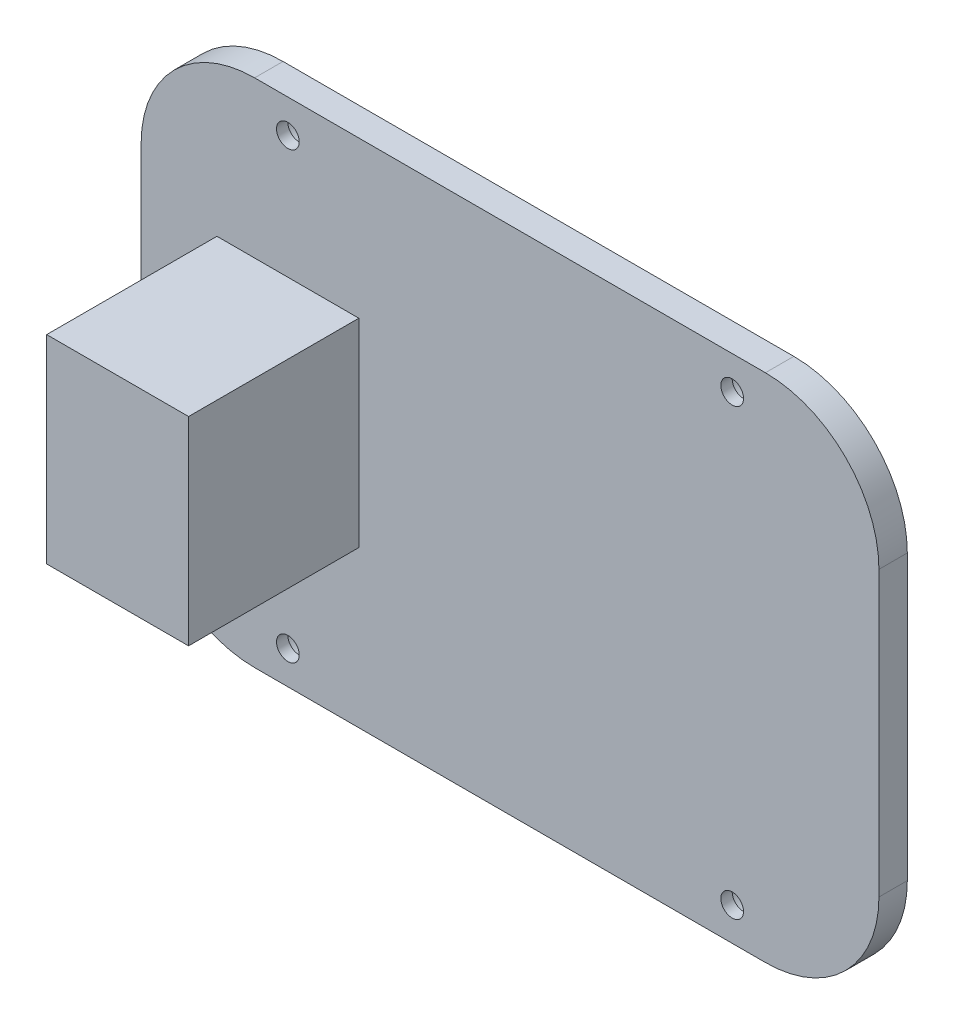
ISO-10303-21;
HEADER;
FILE_DESCRIPTION(('STEP AP214'),'2;1');
FILE_NAME('part.step','',(''),(''),'','','');
FILE_SCHEMA(('AUTOMOTIVE_DESIGN { 1 0 10303 214 1 1 1 1 }'));
ENDSEC;
DATA;
#1=APPLICATION_CONTEXT('core data for automotive mechanical design processes');
#2=APPLICATION_PROTOCOL_DEFINITION('international standard','automotive_design',2000,#1);
#3=PRODUCT_CONTEXT('',#1,'mechanical');
#4=PRODUCT('Part','Part','',(#3));
#5=PRODUCT_RELATED_PRODUCT_CATEGORY('part','',(#4));
#6=PRODUCT_DEFINITION_FORMATION('','',#4);
#7=PRODUCT_DEFINITION_CONTEXT('part definition',#1,'design');
#8=PRODUCT_DEFINITION('design','',#6,#7);
#9=PRODUCT_DEFINITION_SHAPE('','',#8);
#10=(LENGTH_UNIT() NAMED_UNIT(*) SI_UNIT(.MILLI.,.METRE.));
#11=(NAMED_UNIT(*) PLANE_ANGLE_UNIT() SI_UNIT($,.RADIAN.));
#12=(NAMED_UNIT(*) SI_UNIT($,.STERADIAN.) SOLID_ANGLE_UNIT());
#13=UNCERTAINTY_MEASURE_WITH_UNIT(LENGTH_MEASURE(1.E-05),#10,'distance_accuracy_value','');
#14=(GEOMETRIC_REPRESENTATION_CONTEXT(3) GLOBAL_UNCERTAINTY_ASSIGNED_CONTEXT((#13)) GLOBAL_UNIT_ASSIGNED_CONTEXT((#10,
#11,#12)) REPRESENTATION_CONTEXT('',''));
#15=CARTESIAN_POINT('',(0.,0.,0.));
#16=DIRECTION('',(0.,0.,1.));
#17=DIRECTION('',(1.,0.,0.));
#18=AXIS2_PLACEMENT_3D('',#15,#16,#17);
#19=CARTESIAN_POINT('',(0.,0.,5.));
#20=DIRECTION('',(0.,0.,-1.));
#21=DIRECTION('',(-1.,0.,0.));
#22=AXIS2_PLACEMENT_3D('',#19,#20,#21);
#23=PLANE('',#22);
#24=DIRECTION('',(1.,0.,0.));
#25=VECTOR('',#24,1.);
#26=CARTESIAN_POINT('',(-65.,-45.,5.));
#27=LINE('',#26,#25);
#28=CARTESIAN_POINT('',(-45.,-45.,5.));
#29=VERTEX_POINT('',#28);
#30=CARTESIAN_POINT('',(45.,-45.,5.));
#31=VERTEX_POINT('',#30);
#32=EDGE_CURVE('E204',#29,#31,#27,.T.);
#33=ORIENTED_EDGE('',*,*,#32,.T.);
#34=CARTESIAN_POINT('',(45.,-25.,5.));
#35=DIRECTION('',(0.,0.,-1.));
#36=DIRECTION('',(-1.,0.,0.));
#37=AXIS2_PLACEMENT_3D('',#34,#35,#36);
#38=CIRCLE('',#37,20.);
#39=CARTESIAN_POINT('',(65.,-25.,5.));
#40=VERTEX_POINT('',#39);
#41=EDGE_CURVE('E241',#31,#40,#38,.F.);
#42=ORIENTED_EDGE('',*,*,#41,.T.);
#43=DIRECTION('',(0.,1.,0.));
#44=VECTOR('',#43,1.);
#45=CARTESIAN_POINT('',(65.,-45.,5.));
#46=LINE('',#45,#44);
#47=CARTESIAN_POINT('',(65.,25.,5.));
#48=VERTEX_POINT('',#47);
#49=EDGE_CURVE('E194',#40,#48,#46,.T.);
#50=ORIENTED_EDGE('',*,*,#49,.T.);
#51=CARTESIAN_POINT('',(45.,25.,5.));
#52=DIRECTION('',(0.,0.,-1.));
#53=DIRECTION('',(-1.,0.,0.));
#54=AXIS2_PLACEMENT_3D('',#51,#52,#53);
#55=CIRCLE('',#54,20.);
#56=CARTESIAN_POINT('',(45.,45.,5.));
#57=VERTEX_POINT('',#56);
#58=EDGE_CURVE('E237',#48,#57,#55,.F.);
#59=ORIENTED_EDGE('',*,*,#58,.T.);
#60=DIRECTION('',(-1.,0.,0.));
#61=VECTOR('',#60,1.);
#62=CARTESIAN_POINT('',(-65.,45.,5.));
#63=LINE('',#62,#61);
#64=CARTESIAN_POINT('',(-45.,45.,5.));
#65=VERTEX_POINT('',#64);
#66=EDGE_CURVE('E197',#57,#65,#63,.T.);
#67=ORIENTED_EDGE('',*,*,#66,.T.);
#68=CARTESIAN_POINT('',(-45.,25.,5.));
#69=DIRECTION('',(0.,0.,-1.));
#70=DIRECTION('',(-1.,0.,0.));
#71=AXIS2_PLACEMENT_3D('',#68,#69,#70);
#72=CIRCLE('',#71,20.);
#73=CARTESIAN_POINT('',(-65.,25.,5.));
#74=VERTEX_POINT('',#73);
#75=EDGE_CURVE('E235',#65,#74,#72,.F.);
#76=ORIENTED_EDGE('',*,*,#75,.T.);
#77=DIRECTION('',(0.,-1.,0.));
#78=VECTOR('',#77,1.);
#79=CARTESIAN_POINT('',(-65.,-45.,5.));
#80=LINE('',#79,#78);
#81=CARTESIAN_POINT('',(-65.,-25.,5.));
#82=VERTEX_POINT('',#81);
#83=EDGE_CURVE('E201',#74,#82,#80,.T.);
#84=ORIENTED_EDGE('',*,*,#83,.T.);
#85=CARTESIAN_POINT('',(-45.,-25.,5.));
#86=DIRECTION('',(0.,0.,-1.));
#87=DIRECTION('',(-1.,0.,0.));
#88=AXIS2_PLACEMENT_3D('',#85,#86,#87);
#89=CIRCLE('',#88,20.);
#90=EDGE_CURVE('E239',#82,#29,#89,.F.);
#91=ORIENTED_EDGE('',*,*,#90,.T.);
#92=EDGE_LOOP('',(#33,#42,#50,#59,#67,#76,#84,#91));
#93=FACE_BOUND('',#92,.T.);
#94=CARTESIAN_POINT('',(39.1421356237308,39.1421356237309,5.));
#95=DIRECTION('',(0.,0.,-1.));
#96=DIRECTION('',(-1.,0.,0.));
#97=AXIS2_PLACEMENT_3D('',#94,#95,#96);
#98=CIRCLE('',#97,2.);
#99=CARTESIAN_POINT('',(37.1421356237308,39.1421356237309,5.));
#100=VERTEX_POINT('',#99);
#101=EDGE_CURVE('E163',#100,#100,#98,.T.);
#102=ORIENTED_EDGE('',*,*,#101,.T.);
#103=EDGE_LOOP('',(#102));
#104=FACE_BOUND('',#103,.T.);
#105=CARTESIAN_POINT('',(-39.1421356237308,39.1421356237309,5.));
#106=DIRECTION('',(0.,0.,-1.));
#107=DIRECTION('',(-1.,0.,0.));
#108=AXIS2_PLACEMENT_3D('',#105,#106,#107);
#109=CIRCLE('',#108,2.);
#110=CARTESIAN_POINT('',(-41.1421356237308,39.1421356237309,5.));
#111=VERTEX_POINT('',#110);
#112=EDGE_CURVE('E160',#111,#111,#109,.T.);
#113=ORIENTED_EDGE('',*,*,#112,.T.);
#114=EDGE_LOOP('',(#113));
#115=FACE_BOUND('',#114,.T.);
#116=CARTESIAN_POINT('',(-39.1421356237308,-39.1421356237309,5.));
#117=DIRECTION('',(0.,0.,-1.));
#118=DIRECTION('',(-1.,0.,0.));
#119=AXIS2_PLACEMENT_3D('',#116,#117,#118);
#120=CIRCLE('',#119,2.);
#121=CARTESIAN_POINT('',(-41.1421356237308,-39.1421356237309,5.));
#122=VERTEX_POINT('',#121);
#123=EDGE_CURVE('E154',#122,#122,#120,.T.);
#124=ORIENTED_EDGE('',*,*,#123,.T.);
#125=EDGE_LOOP('',(#124));
#126=FACE_BOUND('',#125,.T.);
#127=CARTESIAN_POINT('',(39.1421356237308,-39.1421356237309,5.));
#128=DIRECTION('',(0.,0.,-1.));
#129=DIRECTION('',(-1.,0.,0.));
#130=AXIS2_PLACEMENT_3D('',#127,#128,#129);
#131=CIRCLE('',#130,2.);
#132=CARTESIAN_POINT('',(37.1421356237308,-39.1421356237309,5.));
#133=VERTEX_POINT('',#132);
#134=EDGE_CURVE('E151',#133,#133,#131,.T.);
#135=ORIENTED_EDGE('',*,*,#134,.T.);
#136=EDGE_LOOP('',(#135));
#137=FACE_BOUND('',#136,.T.);
#138=DIRECTION('',(0.,1.,0.));
#139=VECTOR('',#138,1.);
#140=CARTESIAN_POINT('',(-26.6421356237308,-17.5,5.));
#141=LINE('',#140,#139);
#142=CARTESIAN_POINT('',(-26.6421356237308,-17.5,5.));
#143=VERTEX_POINT('',#142);
#144=CARTESIAN_POINT('',(-26.6421356237308,17.5,5.));
#145=VERTEX_POINT('',#144);
#146=EDGE_CURVE('E150',#143,#145,#141,.T.);
#147=ORIENTED_EDGE('',*,*,#146,.F.);
#148=DIRECTION('',(1.,0.,0.));
#149=VECTOR('',#148,1.);
#150=CARTESIAN_POINT('',(-51.6421356237308,-17.5,5.));
#151=LINE('',#150,#149);
#152=CARTESIAN_POINT('',(-51.6421356237308,-17.5,5.));
#153=VERTEX_POINT('',#152);
#154=EDGE_CURVE('E147',#153,#143,#151,.T.);
#155=ORIENTED_EDGE('',*,*,#154,.F.);
#156=DIRECTION('',(0.,-1.,0.));
#157=VECTOR('',#156,1.);
#158=CARTESIAN_POINT('',(-51.6421356237308,-17.5,5.));
#159=LINE('',#158,#157);
#160=CARTESIAN_POINT('',(-51.6421356237308,17.5,5.));
#161=VERTEX_POINT('',#160);
#162=EDGE_CURVE('E61',#161,#153,#159,.T.);
#163=ORIENTED_EDGE('',*,*,#162,.F.);
#164=DIRECTION('',(-1.,0.,0.));
#165=VECTOR('',#164,1.);
#166=CARTESIAN_POINT('',(-51.6421356237308,17.5,5.));
#167=LINE('',#166,#165);
#168=EDGE_CURVE('E56',#145,#161,#167,.T.);
#169=ORIENTED_EDGE('',*,*,#168,.F.);
#170=EDGE_LOOP('',(#147,#155,#163,#169));
#171=FACE_BOUND('',#170,.T.);
#172=ADVANCED_FACE('F39',(#93,#104,#115,#126,#137,#171),#23,.F.);
#173=CARTESIAN_POINT('',(65.,-45.,5.));
#174=DIRECTION('',(-1.,0.,0.));
#175=DIRECTION('',(0.,0.,1.));
#176=AXIS2_PLACEMENT_3D('',#173,#174,#175);
#177=PLANE('',#176);
#178=ORIENTED_EDGE('',*,*,#49,.F.);
#179=DIRECTION('',(0.,0.,-1.));
#180=VECTOR('',#179,1.);
#181=CARTESIAN_POINT('',(65.,-25.,5.));
#182=LINE('',#181,#180);
#183=CARTESIAN_POINT('',(65.,-25.,0.));
#184=VERTEX_POINT('',#183);
#185=EDGE_CURVE('E219',#40,#184,#182,.T.);
#186=ORIENTED_EDGE('',*,*,#185,.T.);
#187=DIRECTION('',(0.,1.,0.));
#188=VECTOR('',#187,1.);
#189=CARTESIAN_POINT('',(65.,-45.,0.));
#190=LINE('',#189,#188);
#191=CARTESIAN_POINT('',(65.,25.,0.));
#192=VERTEX_POINT('',#191);
#193=EDGE_CURVE('E191',#184,#192,#190,.T.);
#194=ORIENTED_EDGE('',*,*,#193,.T.);
#195=DIRECTION('',(0.,0.,-1.));
#196=VECTOR('',#195,1.);
#197=CARTESIAN_POINT('',(65.,25.,5.));
#198=LINE('',#197,#196);
#199=EDGE_CURVE('E207',#192,#48,#198,.F.);
#200=ORIENTED_EDGE('',*,*,#199,.T.);
#201=EDGE_LOOP('',(#178,#186,#194,#200));
#202=FACE_BOUND('',#201,.T.);
#203=ADVANCED_FACE('F289',(#202),#177,.F.);
#204=CARTESIAN_POINT('',(-65.,45.,5.));
#205=DIRECTION('',(0.,-1.,0.));
#206=DIRECTION('',(0.,0.,-1.));
#207=AXIS2_PLACEMENT_3D('',#204,#205,#206);
#208=PLANE('',#207);
#209=ORIENTED_EDGE('',*,*,#66,.F.);
#210=DIRECTION('',(0.,0.,-1.));
#211=VECTOR('',#210,1.);
#212=CARTESIAN_POINT('',(45.,45.,5.));
#213=LINE('',#212,#211);
#214=CARTESIAN_POINT('',(45.,45.,0.));
#215=VERTEX_POINT('',#214);
#216=EDGE_CURVE('E11',#57,#215,#213,.T.);
#217=ORIENTED_EDGE('',*,*,#216,.T.);
#218=DIRECTION('',(-1.,0.,0.));
#219=VECTOR('',#218,1.);
#220=CARTESIAN_POINT('',(-65.,45.,0.));
#221=LINE('',#220,#219);
#222=CARTESIAN_POINT('',(-45.,45.,0.));
#223=VERTEX_POINT('',#222);
#224=EDGE_CURVE('E210',#215,#223,#221,.T.);
#225=ORIENTED_EDGE('',*,*,#224,.T.);
#226=DIRECTION('',(0.,0.,-1.));
#227=VECTOR('',#226,1.);
#228=CARTESIAN_POINT('',(-45.,45.,5.));
#229=LINE('',#228,#227);
#230=EDGE_CURVE('E48',#223,#65,#229,.F.);
#231=ORIENTED_EDGE('',*,*,#230,.T.);
#232=EDGE_LOOP('',(#209,#217,#225,#231));
#233=FACE_BOUND('',#232,.T.);
#234=ADVANCED_FACE('F300',(#233),#208,.F.);
#235=CARTESIAN_POINT('',(-65.,-45.,5.));
#236=DIRECTION('',(1.,0.,0.));
#237=DIRECTION('',(0.,0.,-1.));
#238=AXIS2_PLACEMENT_3D('',#235,#236,#237);
#239=PLANE('',#238);
#240=DIRECTION('',(0.,-1.,0.));
#241=VECTOR('',#240,1.);
#242=CARTESIAN_POINT('',(-65.,-45.,0.));
#243=LINE('',#242,#241);
#244=CARTESIAN_POINT('',(-65.,25.,0.));
#245=VERTEX_POINT('',#244);
#246=CARTESIAN_POINT('',(-65.,-25.,0.));
#247=VERTEX_POINT('',#246);
#248=EDGE_CURVE('E213',#245,#247,#243,.T.);
#249=ORIENTED_EDGE('',*,*,#248,.T.);
#250=DIRECTION('',(0.,0.,-1.));
#251=VECTOR('',#250,1.);
#252=CARTESIAN_POINT('',(-65.,-25.,5.));
#253=LINE('',#252,#251);
#254=EDGE_CURVE('E246',#247,#82,#253,.F.);
#255=ORIENTED_EDGE('',*,*,#254,.T.);
#256=ORIENTED_EDGE('',*,*,#83,.F.);
#257=DIRECTION('',(0.,0.,-1.));
#258=VECTOR('',#257,1.);
#259=CARTESIAN_POINT('',(-65.,25.,5.));
#260=LINE('',#259,#258);
#261=EDGE_CURVE('E243',#74,#245,#260,.T.);
#262=ORIENTED_EDGE('',*,*,#261,.T.);
#263=EDGE_LOOP('',(#249,#255,#256,#262));
#264=FACE_BOUND('',#263,.T.);
#265=ADVANCED_FACE('F307',(#264),#239,.F.);
#266=CARTESIAN_POINT('',(-65.,-45.,5.));
#267=DIRECTION('',(0.,1.,0.));
#268=DIRECTION('',(0.,0.,1.));
#269=AXIS2_PLACEMENT_3D('',#266,#267,#268);
#270=PLANE('',#269);
#271=DIRECTION('',(1.,0.,0.));
#272=VECTOR('',#271,1.);
#273=CARTESIAN_POINT('',(-65.,-45.,0.));
#274=LINE('',#273,#272);
#275=CARTESIAN_POINT('',(-45.,-45.,0.));
#276=VERTEX_POINT('',#275);
#277=CARTESIAN_POINT('',(45.,-45.,0.));
#278=VERTEX_POINT('',#277);
#279=EDGE_CURVE('E198',#276,#278,#274,.T.);
#280=ORIENTED_EDGE('',*,*,#279,.T.);
#281=DIRECTION('',(0.,0.,-1.));
#282=VECTOR('',#281,1.);
#283=CARTESIAN_POINT('',(45.,-45.,5.));
#284=LINE('',#283,#282);
#285=EDGE_CURVE('E233',#278,#31,#284,.F.);
#286=ORIENTED_EDGE('',*,*,#285,.T.);
#287=ORIENTED_EDGE('',*,*,#32,.F.);
#288=DIRECTION('',(0.,0.,-1.));
#289=VECTOR('',#288,1.);
#290=CARTESIAN_POINT('',(-45.,-45.,5.));
#291=LINE('',#290,#289);
#292=EDGE_CURVE('E230',#29,#276,#291,.T.);
#293=ORIENTED_EDGE('',*,*,#292,.T.);
#294=EDGE_LOOP('',(#280,#286,#287,#293));
#295=FACE_BOUND('',#294,.T.);
#296=ADVANCED_FACE('F280',(#295),#270,.F.);
#297=CARTESIAN_POINT('',(0.,0.,0.));
#298=DIRECTION('',(0.,0.,-1.));
#299=DIRECTION('',(-1.,0.,0.));
#300=AXIS2_PLACEMENT_3D('',#297,#298,#299);
#301=PLANE('',#300);
#302=CARTESIAN_POINT('',(-39.1421356237308,39.1421356237309,0.));
#303=DIRECTION('',(0.,0.,-1.));
#304=DIRECTION('',(-1.,0.,0.));
#305=AXIS2_PLACEMENT_3D('',#302,#303,#304);
#306=CIRCLE('',#305,4.00000000000001);
#307=CARTESIAN_POINT('',(-43.1421356237308,39.1421356237309,0.));
#308=VERTEX_POINT('',#307);
#309=EDGE_CURVE('E180',#308,#308,#306,.T.);
#310=ORIENTED_EDGE('',*,*,#309,.F.);
#311=EDGE_LOOP('',(#310));
#312=FACE_BOUND('',#311,.T.);
#313=CARTESIAN_POINT('',(39.1421356237308,-39.1421356237309,0.));
#314=DIRECTION('',(0.,0.,-1.));
#315=DIRECTION('',(-1.,0.,0.));
#316=AXIS2_PLACEMENT_3D('',#313,#314,#315);
#317=CIRCLE('',#316,4.00000000000001);
#318=CARTESIAN_POINT('',(35.1421356237308,-39.1421356237309,0.));
#319=VERTEX_POINT('',#318);
#320=EDGE_CURVE('E172',#319,#319,#317,.T.);
#321=ORIENTED_EDGE('',*,*,#320,.F.);
#322=EDGE_LOOP('',(#321));
#323=FACE_BOUND('',#322,.T.);
#324=CARTESIAN_POINT('',(-39.1421356237308,-39.1421356237309,0.));
#325=DIRECTION('',(0.,0.,-1.));
#326=DIRECTION('',(-1.,0.,0.));
#327=AXIS2_PLACEMENT_3D('',#324,#325,#326);
#328=CIRCLE('',#327,4.00000000000001);
#329=CARTESIAN_POINT('',(-43.1421356237308,-39.1421356237309,0.));
#330=VERTEX_POINT('',#329);
#331=EDGE_CURVE('E173',#330,#330,#328,.T.);
#332=ORIENTED_EDGE('',*,*,#331,.F.);
#333=EDGE_LOOP('',(#332));
#334=FACE_BOUND('',#333,.T.);
#335=CARTESIAN_POINT('',(39.1421356237308,39.1421356237309,0.));
#336=DIRECTION('',(0.,0.,-1.));
#337=DIRECTION('',(-1.,0.,0.));
#338=AXIS2_PLACEMENT_3D('',#335,#336,#337);
#339=CIRCLE('',#338,4.00000000000001);
#340=CARTESIAN_POINT('',(35.1421356237308,39.1421356237309,0.));
#341=VERTEX_POINT('',#340);
#342=EDGE_CURVE('E179',#341,#341,#339,.T.);
#343=ORIENTED_EDGE('',*,*,#342,.F.);
#344=EDGE_LOOP('',(#343));
#345=FACE_BOUND('',#344,.T.);
#346=ORIENTED_EDGE('',*,*,#193,.F.);
#347=CARTESIAN_POINT('',(45.,-25.,0.));
#348=DIRECTION('',(0.,0.,-1.));
#349=DIRECTION('',(-1.,0.,0.));
#350=AXIS2_PLACEMENT_3D('',#347,#348,#349);
#351=CIRCLE('',#350,20.);
#352=EDGE_CURVE('E228',#184,#278,#351,.T.);
#353=ORIENTED_EDGE('',*,*,#352,.T.);
#354=ORIENTED_EDGE('',*,*,#279,.F.);
#355=CARTESIAN_POINT('',(-45.,-25.,0.));
#356=DIRECTION('',(0.,0.,-1.));
#357=DIRECTION('',(-1.,0.,0.));
#358=AXIS2_PLACEMENT_3D('',#355,#356,#357);
#359=CIRCLE('',#358,20.);
#360=EDGE_CURVE('E226',#276,#247,#359,.T.);
#361=ORIENTED_EDGE('',*,*,#360,.T.);
#362=ORIENTED_EDGE('',*,*,#248,.F.);
#363=CARTESIAN_POINT('',(-45.,25.,0.));
#364=DIRECTION('',(0.,0.,-1.));
#365=DIRECTION('',(-1.,0.,0.));
#366=AXIS2_PLACEMENT_3D('',#363,#364,#365);
#367=CIRCLE('',#366,20.);
#368=EDGE_CURVE('E222',#245,#223,#367,.T.);
#369=ORIENTED_EDGE('',*,*,#368,.T.);
#370=ORIENTED_EDGE('',*,*,#224,.F.);
#371=CARTESIAN_POINT('',(45.,25.,0.));
#372=DIRECTION('',(0.,0.,-1.));
#373=DIRECTION('',(-1.,0.,0.));
#374=AXIS2_PLACEMENT_3D('',#371,#372,#373);
#375=CIRCLE('',#374,20.);
#376=EDGE_CURVE('E224',#215,#192,#375,.T.);
#377=ORIENTED_EDGE('',*,*,#376,.T.);
#378=EDGE_LOOP('',(#346,#353,#354,#361,#362,#369,#370,#377));
#379=FACE_BOUND('',#378,.T.);
#380=ADVANCED_FACE('F276',(#312,#323,#334,#345,#379),#301,.T.);
#381=CARTESIAN_POINT('',(45.,-25.,5.));
#382=DIRECTION('',(0.,0.,-1.));
#383=DIRECTION('',(-1.,0.,0.));
#384=AXIS2_PLACEMENT_3D('',#381,#382,#383);
#385=CYLINDRICAL_SURFACE('',#384,20.);
#386=ORIENTED_EDGE('',*,*,#41,.F.);
#387=ORIENTED_EDGE('',*,*,#285,.F.);
#388=ORIENTED_EDGE('',*,*,#352,.F.);
#389=ORIENTED_EDGE('',*,*,#185,.F.);
#390=EDGE_LOOP('',(#386,#387,#388,#389));
#391=FACE_BOUND('',#390,.T.);
#392=ADVANCED_FACE('F279',(#391),#385,.T.);
#393=CARTESIAN_POINT('',(-45.,-25.,5.));
#394=DIRECTION('',(0.,0.,-1.));
#395=DIRECTION('',(-1.,0.,0.));
#396=AXIS2_PLACEMENT_3D('',#393,#394,#395);
#397=CYLINDRICAL_SURFACE('',#396,20.);
#398=ORIENTED_EDGE('',*,*,#90,.F.);
#399=ORIENTED_EDGE('',*,*,#254,.F.);
#400=ORIENTED_EDGE('',*,*,#360,.F.);
#401=ORIENTED_EDGE('',*,*,#292,.F.);
#402=EDGE_LOOP('',(#398,#399,#400,#401));
#403=FACE_BOUND('',#402,.T.);
#404=ADVANCED_FACE('F311',(#403),#397,.T.);
#405=CARTESIAN_POINT('',(45.,25.,5.));
#406=DIRECTION('',(0.,0.,-1.));
#407=DIRECTION('',(-1.,0.,0.));
#408=AXIS2_PLACEMENT_3D('',#405,#406,#407);
#409=CYLINDRICAL_SURFACE('',#408,20.);
#410=ORIENTED_EDGE('',*,*,#58,.F.);
#411=ORIENTED_EDGE('',*,*,#199,.F.);
#412=ORIENTED_EDGE('',*,*,#376,.F.);
#413=ORIENTED_EDGE('',*,*,#216,.F.);
#414=EDGE_LOOP('',(#410,#411,#412,#413));
#415=FACE_BOUND('',#414,.T.);
#416=ADVANCED_FACE('F293',(#415),#409,.T.);
#417=CARTESIAN_POINT('',(-45.,25.,5.));
#418=DIRECTION('',(0.,0.,-1.));
#419=DIRECTION('',(-1.,0.,0.));
#420=AXIS2_PLACEMENT_3D('',#417,#418,#419);
#421=CYLINDRICAL_SURFACE('',#420,20.);
#422=ORIENTED_EDGE('',*,*,#75,.F.);
#423=ORIENTED_EDGE('',*,*,#230,.F.);
#424=ORIENTED_EDGE('',*,*,#368,.F.);
#425=ORIENTED_EDGE('',*,*,#261,.F.);
#426=EDGE_LOOP('',(#422,#423,#424,#425));
#427=FACE_BOUND('',#426,.T.);
#428=ADVANCED_FACE('F41',(#427),#421,.T.);
#429=CARTESIAN_POINT('',(39.1421356237308,39.1421356237309,3.));
#430=DIRECTION('',(0.,0.,-1.));
#431=DIRECTION('',(-1.,0.,0.));
#432=AXIS2_PLACEMENT_3D('',#429,#430,#431);
#433=CYLINDRICAL_SURFACE('',#432,4.00000000000001);
#434=CARTESIAN_POINT('',(39.1421356237308,39.1421356237309,3.));
#435=DIRECTION('',(0.,0.,-1.));
#436=DIRECTION('',(-1.,0.,0.));
#437=AXIS2_PLACEMENT_3D('',#434,#435,#436);
#438=CIRCLE('',#437,4.00000000000001);
#439=CARTESIAN_POINT('',(35.1421356237308,39.1421356237309,3.));
#440=VERTEX_POINT('',#439);
#441=EDGE_CURVE('E188',#440,#440,#438,.T.);
#442=ORIENTED_EDGE('',*,*,#441,.F.);
#443=EDGE_LOOP('',(#442));
#444=FACE_BOUND('',#443,.T.);
#445=ORIENTED_EDGE('',*,*,#342,.T.);
#446=EDGE_LOOP('',(#445));
#447=FACE_BOUND('',#446,.T.);
#448=ADVANCED_FACE('F267',(#444,#447),#433,.F.);
#449=CARTESIAN_POINT('',(39.1421356237308,39.1421356237309,3.));
#450=DIRECTION('',(0.,0.,-1.));
#451=DIRECTION('',(-1.,0.,0.));
#452=AXIS2_PLACEMENT_3D('',#449,#450,#451);
#453=PLANE('',#452);
#454=CARTESIAN_POINT('',(39.1421356237308,39.1421356237309,3.));
#455=DIRECTION('',(0.,0.,-1.));
#456=DIRECTION('',(-1.,0.,0.));
#457=AXIS2_PLACEMENT_3D('',#454,#455,#456);
#458=CIRCLE('',#457,2.);
#459=CARTESIAN_POINT('',(37.1421356237308,39.1421356237309,3.));
#460=VERTEX_POINT('',#459);
#461=EDGE_CURVE('E43',#460,#460,#458,.T.);
#462=ORIENTED_EDGE('',*,*,#461,.F.);
#463=EDGE_LOOP('',(#462));
#464=FACE_BOUND('',#463,.T.);
#465=ORIENTED_EDGE('',*,*,#441,.T.);
#466=EDGE_LOOP('',(#465));
#467=FACE_BOUND('',#466,.T.);
#468=ADVANCED_FACE('F263',(#464,#467),#453,.T.);
#469=CARTESIAN_POINT('',(-39.1421356237308,-39.1421356237309,3.));
#470=DIRECTION('',(0.,0.,-1.));
#471=DIRECTION('',(-1.,0.,0.));
#472=AXIS2_PLACEMENT_3D('',#469,#470,#471);
#473=CYLINDRICAL_SURFACE('',#472,4.00000000000001);
#474=CARTESIAN_POINT('',(-39.1421356237308,-39.1421356237309,3.));
#475=DIRECTION('',(0.,0.,-1.));
#476=DIRECTION('',(-1.,0.,0.));
#477=AXIS2_PLACEMENT_3D('',#474,#475,#476);
#478=CIRCLE('',#477,4.00000000000001);
#479=CARTESIAN_POINT('',(-43.1421356237308,-39.1421356237309,3.));
#480=VERTEX_POINT('',#479);
#481=EDGE_CURVE('E169',#480,#480,#478,.T.);
#482=ORIENTED_EDGE('',*,*,#481,.F.);
#483=EDGE_LOOP('',(#482));
#484=FACE_BOUND('',#483,.T.);
#485=ORIENTED_EDGE('',*,*,#331,.T.);
#486=EDGE_LOOP('',(#485));
#487=FACE_BOUND('',#486,.T.);
#488=ADVANCED_FACE('F266',(#484,#487),#473,.F.);
#489=CARTESIAN_POINT('',(-39.1421356237308,-39.1421356237309,3.));
#490=DIRECTION('',(0.,0.,-1.));
#491=DIRECTION('',(-1.,0.,0.));
#492=AXIS2_PLACEMENT_3D('',#489,#490,#491);
#493=PLANE('',#492);
#494=CARTESIAN_POINT('',(-39.1421356237308,-39.1421356237309,3.));
#495=DIRECTION('',(0.,0.,-1.));
#496=DIRECTION('',(-1.,0.,0.));
#497=AXIS2_PLACEMENT_3D('',#494,#495,#496);
#498=CIRCLE('',#497,2.);
#499=CARTESIAN_POINT('',(-41.1421356237308,-39.1421356237309,3.));
#500=VERTEX_POINT('',#499);
#501=EDGE_CURVE('E253',#500,#500,#498,.T.);
#502=ORIENTED_EDGE('',*,*,#501,.F.);
#503=EDGE_LOOP('',(#502));
#504=FACE_BOUND('',#503,.T.);
#505=ORIENTED_EDGE('',*,*,#481,.T.);
#506=EDGE_LOOP('',(#505));
#507=FACE_BOUND('',#506,.T.);
#508=ADVANCED_FACE('F387',(#504,#507),#493,.T.);
#509=CARTESIAN_POINT('',(39.1421356237308,-39.1421356237309,3.));
#510=DIRECTION('',(0.,0.,-1.));
#511=DIRECTION('',(-1.,0.,0.));
#512=AXIS2_PLACEMENT_3D('',#509,#510,#511);
#513=CYLINDRICAL_SURFACE('',#512,4.00000000000001);
#514=CARTESIAN_POINT('',(39.1421356237308,-39.1421356237309,3.));
#515=DIRECTION('',(0.,0.,-1.));
#516=DIRECTION('',(-1.,0.,0.));
#517=AXIS2_PLACEMENT_3D('',#514,#515,#516);
#518=CIRCLE('',#517,4.00000000000001);
#519=CARTESIAN_POINT('',(35.1421356237308,-39.1421356237309,3.));
#520=VERTEX_POINT('',#519);
#521=EDGE_CURVE('E183',#520,#520,#518,.T.);
#522=ORIENTED_EDGE('',*,*,#521,.F.);
#523=EDGE_LOOP('',(#522));
#524=FACE_BOUND('',#523,.T.);
#525=ORIENTED_EDGE('',*,*,#320,.T.);
#526=EDGE_LOOP('',(#525));
#527=FACE_BOUND('',#526,.T.);
#528=ADVANCED_FACE('F395',(#524,#527),#513,.F.);
#529=CARTESIAN_POINT('',(39.1421356237308,-39.1421356237309,3.));
#530=DIRECTION('',(0.,0.,-1.));
#531=DIRECTION('',(-1.,0.,0.));
#532=AXIS2_PLACEMENT_3D('',#529,#530,#531);
#533=PLANE('',#532);
#534=CARTESIAN_POINT('',(39.1421356237308,-39.1421356237309,3.));
#535=DIRECTION('',(0.,0.,-1.));
#536=DIRECTION('',(-1.,0.,0.));
#537=AXIS2_PLACEMENT_3D('',#534,#535,#536);
#538=CIRCLE('',#537,2.);
#539=CARTESIAN_POINT('',(37.1421356237308,-39.1421356237309,3.));
#540=VERTEX_POINT('',#539);
#541=EDGE_CURVE('E251',#540,#540,#538,.T.);
#542=ORIENTED_EDGE('',*,*,#541,.F.);
#543=EDGE_LOOP('',(#542));
#544=FACE_BOUND('',#543,.T.);
#545=ORIENTED_EDGE('',*,*,#521,.T.);
#546=EDGE_LOOP('',(#545));
#547=FACE_BOUND('',#546,.T.);
#548=ADVANCED_FACE('F403',(#544,#547),#533,.T.);
#549=CARTESIAN_POINT('',(-39.1421356237308,39.1421356237309,3.));
#550=DIRECTION('',(0.,0.,-1.));
#551=DIRECTION('',(-1.,0.,0.));
#552=AXIS2_PLACEMENT_3D('',#549,#550,#551);
#553=CYLINDRICAL_SURFACE('',#552,4.00000000000001);
#554=CARTESIAN_POINT('',(-39.1421356237308,39.1421356237309,3.));
#555=DIRECTION('',(0.,0.,-1.));
#556=DIRECTION('',(-1.,0.,0.));
#557=AXIS2_PLACEMENT_3D('',#554,#555,#556);
#558=CIRCLE('',#557,4.00000000000001);
#559=CARTESIAN_POINT('',(-43.1421356237308,39.1421356237309,3.));
#560=VERTEX_POINT('',#559);
#561=EDGE_CURVE('E176',#560,#560,#558,.T.);
#562=ORIENTED_EDGE('',*,*,#561,.F.);
#563=EDGE_LOOP('',(#562));
#564=FACE_BOUND('',#563,.T.);
#565=ORIENTED_EDGE('',*,*,#309,.T.);
#566=EDGE_LOOP('',(#565));
#567=FACE_BOUND('',#566,.T.);
#568=ADVANCED_FACE('F410',(#564,#567),#553,.F.);
#569=CARTESIAN_POINT('',(-39.1421356237308,39.1421356237309,3.));
#570=DIRECTION('',(0.,0.,-1.));
#571=DIRECTION('',(-1.,0.,0.));
#572=AXIS2_PLACEMENT_3D('',#569,#570,#571);
#573=PLANE('',#572);
#574=CARTESIAN_POINT('',(-39.1421356237308,39.1421356237309,3.));
#575=DIRECTION('',(0.,0.,-1.));
#576=DIRECTION('',(-1.,0.,0.));
#577=AXIS2_PLACEMENT_3D('',#574,#575,#576);
#578=CIRCLE('',#577,2.);
#579=CARTESIAN_POINT('',(-41.1421356237308,39.1421356237309,3.));
#580=VERTEX_POINT('',#579);
#581=EDGE_CURVE('E168',#580,#580,#578,.T.);
#582=ORIENTED_EDGE('',*,*,#581,.F.);
#583=EDGE_LOOP('',(#582));
#584=FACE_BOUND('',#583,.T.);
#585=ORIENTED_EDGE('',*,*,#561,.T.);
#586=EDGE_LOOP('',(#585));
#587=FACE_BOUND('',#586,.T.);
#588=ADVANCED_FACE('F418',(#584,#587),#573,.T.);
#589=CARTESIAN_POINT('',(-39.1421356237308,39.1421356237309,5.));
#590=DIRECTION('',(0.,0.,-1.));
#591=DIRECTION('',(-1.,0.,0.));
#592=AXIS2_PLACEMENT_3D('',#589,#590,#591);
#593=CYLINDRICAL_SURFACE('',#592,2.);
#594=ORIENTED_EDGE('',*,*,#581,.T.);
#595=EDGE_LOOP('',(#594));
#596=FACE_BOUND('',#595,.T.);
#597=ORIENTED_EDGE('',*,*,#112,.F.);
#598=EDGE_LOOP('',(#597));
#599=FACE_BOUND('',#598,.T.);
#600=ADVANCED_FACE('F425',(#596,#599),#593,.F.);
#601=CARTESIAN_POINT('',(39.1421356237308,-39.1421356237309,5.));
#602=DIRECTION('',(0.,0.,-1.));
#603=DIRECTION('',(-1.,0.,0.));
#604=AXIS2_PLACEMENT_3D('',#601,#602,#603);
#605=CYLINDRICAL_SURFACE('',#604,2.);
#606=ORIENTED_EDGE('',*,*,#541,.T.);
#607=EDGE_LOOP('',(#606));
#608=FACE_BOUND('',#607,.T.);
#609=ORIENTED_EDGE('',*,*,#134,.F.);
#610=EDGE_LOOP('',(#609));
#611=FACE_BOUND('',#610,.T.);
#612=ADVANCED_FACE('F433',(#608,#611),#605,.F.);
#613=CARTESIAN_POINT('',(-39.1421356237308,-39.1421356237309,5.));
#614=DIRECTION('',(0.,0.,-1.));
#615=DIRECTION('',(-1.,0.,0.));
#616=AXIS2_PLACEMENT_3D('',#613,#614,#615);
#617=CYLINDRICAL_SURFACE('',#616,2.);
#618=ORIENTED_EDGE('',*,*,#501,.T.);
#619=EDGE_LOOP('',(#618));
#620=FACE_BOUND('',#619,.T.);
#621=ORIENTED_EDGE('',*,*,#123,.F.);
#622=EDGE_LOOP('',(#621));
#623=FACE_BOUND('',#622,.T.);
#624=ADVANCED_FACE('F441',(#620,#623),#617,.F.);
#625=CARTESIAN_POINT('',(39.1421356237308,39.1421356237309,5.));
#626=DIRECTION('',(0.,0.,-1.));
#627=DIRECTION('',(-1.,0.,0.));
#628=AXIS2_PLACEMENT_3D('',#625,#626,#627);
#629=CYLINDRICAL_SURFACE('',#628,2.);
#630=ORIENTED_EDGE('',*,*,#461,.T.);
#631=EDGE_LOOP('',(#630));
#632=FACE_BOUND('',#631,.T.);
#633=ORIENTED_EDGE('',*,*,#101,.F.);
#634=EDGE_LOOP('',(#633));
#635=FACE_BOUND('',#634,.T.);
#636=ADVANCED_FACE('F260',(#632,#635),#629,.F.);
#637=CARTESIAN_POINT('',(-26.6421356237308,-17.5,35.));
#638=DIRECTION('',(-1.,0.,0.));
#639=DIRECTION('',(0.,0.,1.));
#640=AXIS2_PLACEMENT_3D('',#637,#638,#639);
#641=PLANE('',#640);
#642=ORIENTED_EDGE('',*,*,#146,.T.);
#643=DIRECTION('',(0.,0.,-1.));
#644=VECTOR('',#643,1.);
#645=CARTESIAN_POINT('',(-26.6421356237308,17.5,35.));
#646=LINE('',#645,#644);
#647=CARTESIAN_POINT('',(-26.6421356237308,17.5,35.));
#648=VERTEX_POINT('',#647);
#649=EDGE_CURVE('E131',#648,#145,#646,.T.);
#650=ORIENTED_EDGE('',*,*,#649,.F.);
#651=DIRECTION('',(0.,1.,0.));
#652=VECTOR('',#651,1.);
#653=CARTESIAN_POINT('',(-26.6421356237308,-17.5,35.));
#654=LINE('',#653,#652);
#655=CARTESIAN_POINT('',(-26.6421356237308,-17.5,35.));
#656=VERTEX_POINT('',#655);
#657=EDGE_CURVE('E138',#656,#648,#654,.T.);
#658=ORIENTED_EDGE('',*,*,#657,.F.);
#659=DIRECTION('',(0.,0.,-1.));
#660=VECTOR('',#659,1.);
#661=CARTESIAN_POINT('',(-26.6421356237308,-17.5,35.));
#662=LINE('',#661,#660);
#663=EDGE_CURVE('E492',#656,#143,#662,.T.);
#664=ORIENTED_EDGE('',*,*,#663,.T.);
#665=EDGE_LOOP('',(#642,#650,#658,#664));
#666=FACE_BOUND('',#665,.T.);
#667=ADVANCED_FACE('F149',(#666),#641,.F.);
#668=CARTESIAN_POINT('',(-51.6421356237308,17.5,35.));
#669=DIRECTION('',(0.,-1.,0.));
#670=DIRECTION('',(0.,0.,-1.));
#671=AXIS2_PLACEMENT_3D('',#668,#669,#670);
#672=PLANE('',#671);
#673=ORIENTED_EDGE('',*,*,#168,.T.);
#674=DIRECTION('',(0.,0.,-1.));
#675=VECTOR('',#674,1.);
#676=CARTESIAN_POINT('',(-51.6421356237308,17.5,35.));
#677=LINE('',#676,#675);
#678=CARTESIAN_POINT('',(-51.6421356237308,17.5,35.));
#679=VERTEX_POINT('',#678);
#680=EDGE_CURVE('E134',#679,#161,#677,.T.);
#681=ORIENTED_EDGE('',*,*,#680,.F.);
#682=DIRECTION('',(-1.,0.,0.));
#683=VECTOR('',#682,1.);
#684=CARTESIAN_POINT('',(-51.6421356237308,17.5,35.));
#685=LINE('',#684,#683);
#686=EDGE_CURVE('E127',#648,#679,#685,.T.);
#687=ORIENTED_EDGE('',*,*,#686,.F.);
#688=ORIENTED_EDGE('',*,*,#649,.T.);
#689=EDGE_LOOP('',(#673,#681,#687,#688));
#690=FACE_BOUND('',#689,.T.);
#691=ADVANCED_FACE('F129',(#690),#672,.F.);
#692=CARTESIAN_POINT('',(-51.6421356237308,-17.5,35.));
#693=DIRECTION('',(1.,0.,0.));
#694=DIRECTION('',(0.,0.,-1.));
#695=AXIS2_PLACEMENT_3D('',#692,#693,#694);
#696=PLANE('',#695);
#697=ORIENTED_EDGE('',*,*,#162,.T.);
#698=DIRECTION('',(0.,0.,-1.));
#699=VECTOR('',#698,1.);
#700=CARTESIAN_POINT('',(-51.6421356237308,-17.5,35.));
#701=LINE('',#700,#699);
#702=CARTESIAN_POINT('',(-51.6421356237308,-17.5,35.));
#703=VERTEX_POINT('',#702);
#704=EDGE_CURVE('E156',#703,#153,#701,.T.);
#705=ORIENTED_EDGE('',*,*,#704,.F.);
#706=DIRECTION('',(0.,-1.,0.));
#707=VECTOR('',#706,1.);
#708=CARTESIAN_POINT('',(-51.6421356237308,-17.5,35.));
#709=LINE('',#708,#707);
#710=EDGE_CURVE('E137',#679,#703,#709,.T.);
#711=ORIENTED_EDGE('',*,*,#710,.F.);
#712=ORIENTED_EDGE('',*,*,#680,.T.);
#713=EDGE_LOOP('',(#697,#705,#711,#712));
#714=FACE_BOUND('',#713,.T.);
#715=ADVANCED_FACE('F467',(#714),#696,.F.);
#716=CARTESIAN_POINT('',(-51.6421356237308,-17.5,35.));
#717=DIRECTION('',(0.,1.,0.));
#718=DIRECTION('',(0.,0.,1.));
#719=AXIS2_PLACEMENT_3D('',#716,#717,#718);
#720=PLANE('',#719);
#721=ORIENTED_EDGE('',*,*,#154,.T.);
#722=ORIENTED_EDGE('',*,*,#663,.F.);
#723=DIRECTION('',(1.,0.,0.));
#724=VECTOR('',#723,1.);
#725=CARTESIAN_POINT('',(-51.6421356237308,-17.5,35.));
#726=LINE('',#725,#724);
#727=EDGE_CURVE('E143',#703,#656,#726,.T.);
#728=ORIENTED_EDGE('',*,*,#727,.F.);
#729=ORIENTED_EDGE('',*,*,#704,.T.);
#730=EDGE_LOOP('',(#721,#722,#728,#729));
#731=FACE_BOUND('',#730,.T.);
#732=ADVANCED_FACE('F474',(#731),#720,.F.);
#733=CARTESIAN_POINT('',(0.,0.,35.));
#734=DIRECTION('',(0.,0.,-1.));
#735=DIRECTION('',(-1.,0.,0.));
#736=AXIS2_PLACEMENT_3D('',#733,#734,#735);
#737=PLANE('',#736);
#738=ORIENTED_EDGE('',*,*,#657,.T.);
#739=ORIENTED_EDGE('',*,*,#686,.T.);
#740=ORIENTED_EDGE('',*,*,#710,.T.);
#741=ORIENTED_EDGE('',*,*,#727,.T.);
#742=EDGE_LOOP('',(#738,#739,#740,#741));
#743=FACE_BOUND('',#742,.T.);
#744=ADVANCED_FACE('F141',(#743),#737,.F.);
#745=CLOSED_SHELL('',(#172,#203,#234,#265,#296,#380,#392,#404,#416,#428,#448,#468,#488,#508,
#528,#548,#568,#588,#600,#612,#624,#636,#667,#691,#715,#732,#744));
#746=MANIFOLD_SOLID_BREP('B2',#745);
#747=ADVANCED_BREP_SHAPE_REPRESENTATION('',(#18,#746),#14);
#748=SHAPE_DEFINITION_REPRESENTATION(#9,#747);
ENDSEC;
END-ISO-10303-21;
